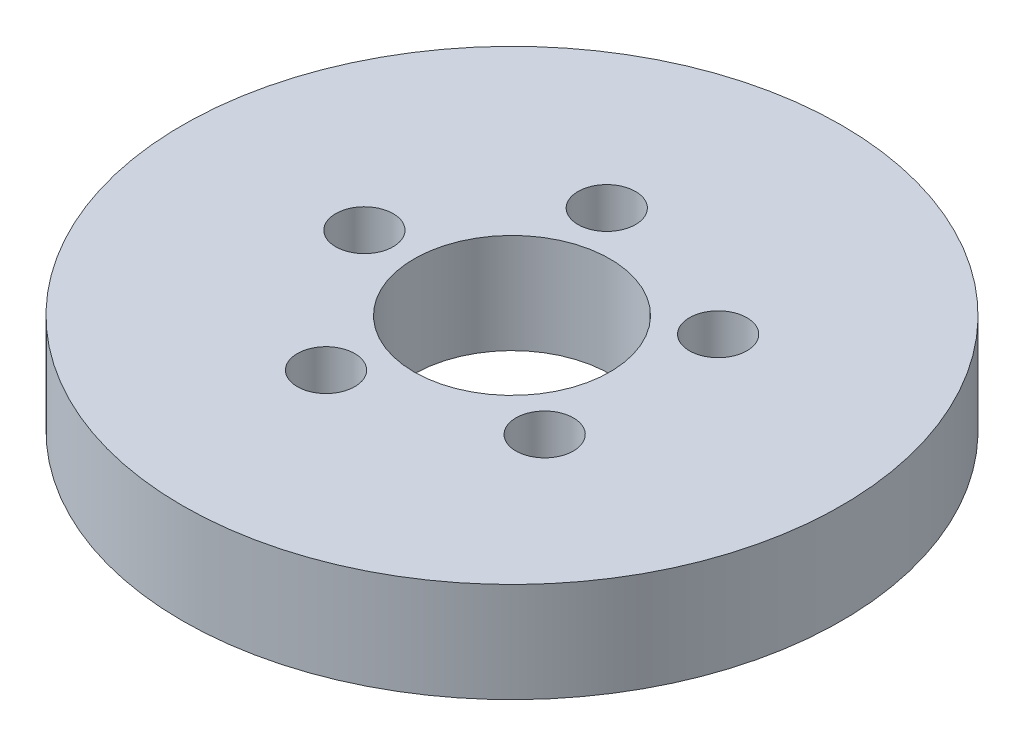
ISO-10303-21;
HEADER;
FILE_DESCRIPTION(('STEP AP214'),'2;1');
FILE_NAME('part.step','',(''),(''),'','','');
FILE_SCHEMA(('AUTOMOTIVE_DESIGN { 1 0 10303 214 1 1 1 1 }'));
ENDSEC;
DATA;
#1=APPLICATION_CONTEXT('core data for automotive mechanical design processes');
#2=APPLICATION_PROTOCOL_DEFINITION('international standard','automotive_design',2000,#1);
#3=PRODUCT_CONTEXT('',#1,'mechanical');
#4=PRODUCT('Part','Part','',(#3));
#5=PRODUCT_RELATED_PRODUCT_CATEGORY('part','',(#4));
#6=PRODUCT_DEFINITION_FORMATION('','',#4);
#7=PRODUCT_DEFINITION_CONTEXT('part definition',#1,'design');
#8=PRODUCT_DEFINITION('design','',#6,#7);
#9=PRODUCT_DEFINITION_SHAPE('','',#8);
#10=(LENGTH_UNIT() NAMED_UNIT(*) SI_UNIT(.MILLI.,.METRE.));
#11=(NAMED_UNIT(*) PLANE_ANGLE_UNIT() SI_UNIT($,.RADIAN.));
#12=(NAMED_UNIT(*) SI_UNIT($,.STERADIAN.) SOLID_ANGLE_UNIT());
#13=UNCERTAINTY_MEASURE_WITH_UNIT(LENGTH_MEASURE(1.E-05),#10,'distance_accuracy_value','');
#14=(GEOMETRIC_REPRESENTATION_CONTEXT(3) GLOBAL_UNCERTAINTY_ASSIGNED_CONTEXT((#13)) GLOBAL_UNIT_ASSIGNED_CONTEXT((#10,
#11,#12)) REPRESENTATION_CONTEXT('',''));
#15=CARTESIAN_POINT('',(0.,0.,0.));
#16=DIRECTION('',(0.,0.,1.));
#17=DIRECTION('',(1.,0.,0.));
#18=AXIS2_PLACEMENT_3D('',#15,#16,#17);
#19=CARTESIAN_POINT('',(0.,28.,0.));
#20=DIRECTION('',(0.,-1.,0.));
#21=DIRECTION('',(0.,0.,-1.));
#22=AXIS2_PLACEMENT_3D('',#19,#20,#21);
#23=CYLINDRICAL_SURFACE('',#22,92.5);
#24=CARTESIAN_POINT('',(0.,28.,0.));
#25=DIRECTION('',(0.,1.,0.));
#26=DIRECTION('',(0.,0.,1.));
#27=AXIS2_PLACEMENT_3D('',#24,#25,#26);
#28=CIRCLE('',#27,92.5);
#29=CARTESIAN_POINT('',(0.,28.,92.5));
#30=VERTEX_POINT('',#29);
#31=EDGE_CURVE('E10',#30,#30,#28,.T.);
#32=ORIENTED_EDGE('',*,*,#31,.F.);
#33=EDGE_LOOP('',(#32));
#34=FACE_BOUND('',#33,.T.);
#35=CARTESIAN_POINT('',(0.,0.,0.));
#36=DIRECTION('',(0.,1.,0.));
#37=DIRECTION('',(0.,0.,1.));
#38=AXIS2_PLACEMENT_3D('',#35,#36,#37);
#39=CIRCLE('',#38,92.5);
#40=CARTESIAN_POINT('',(0.,0.,92.5));
#41=VERTEX_POINT('',#40);
#42=EDGE_CURVE('E37',#41,#41,#39,.T.);
#43=ORIENTED_EDGE('',*,*,#42,.T.);
#44=EDGE_LOOP('',(#43));
#45=FACE_BOUND('',#44,.T.);
#46=ADVANCED_FACE('F40',(#34,#45),#23,.T.);
#47=CARTESIAN_POINT('',(0.,28.,0.));
#48=DIRECTION('',(0.,1.,0.));
#49=DIRECTION('',(0.,0.,1.));
#50=AXIS2_PLACEMENT_3D('',#47,#48,#49);
#51=PLANE('',#50);
#52=CARTESIAN_POINT('',(-12.8016377738142,28.,-39.3993898253473));
#53=DIRECTION('',(0.,1.,0.));
#54=DIRECTION('',(-0.95105651629515,0.,0.309016994374958));
#55=AXIS2_PLACEMENT_3D('',#52,#53,#54);
#56=CIRCLE('',#55,8.06723917707459);
#57=CARTESIAN_POINT('',(-20.4740381616825,28.,-36.9064758219438));
#58=VERTEX_POINT('',#57);
#59=EDGE_CURVE('E70',#58,#58,#56,.T.);
#60=ORIENTED_EDGE('',*,*,#59,.F.);
#61=EDGE_LOOP('',(#60));
#62=FACE_BOUND('',#61,.T.);
#63=CARTESIAN_POINT('',(33.5151228035087,28.,-24.3501620480718));
#64=DIRECTION('',(0.,1.,0.));
#65=DIRECTION('',(-0.58778525229248,0.,-0.809016994374942));
#66=AXIS2_PLACEMENT_3D('',#63,#64,#65);
#67=CIRCLE('',#66,8.06723917707459);
#68=CARTESIAN_POINT('',(28.7733185885082,28.,-30.8766956400125));
#69=VERTEX_POINT('',#68);
#70=EDGE_CURVE('E71',#69,#69,#67,.T.);
#71=ORIENTED_EDGE('',*,*,#70,.F.);
#72=EDGE_LOOP('',(#71));
#73=FACE_BOUND('',#72,.T.);
#74=CARTESIAN_POINT('',(33.5151228035091,28.,24.3501620480713));
#75=DIRECTION('',(0.,1.,0.));
#76=DIRECTION('',(0.587785252292469,0.,-0.809016994374951));
#77=AXIS2_PLACEMENT_3D('',#74,#75,#76);
#78=CIRCLE('',#77,8.06723917707459);
#79=CARTESIAN_POINT('',(38.2569270185095,28.,17.8236284561306));
#80=VERTEX_POINT('',#79);
#81=EDGE_CURVE('E78',#80,#80,#78,.T.);
#82=ORIENTED_EDGE('',*,*,#81,.F.);
#83=EDGE_LOOP('',(#82));
#84=FACE_BOUND('',#83,.T.);
#85=CARTESIAN_POINT('',(-12.8016377738136,28.,39.3993898253475));
#86=DIRECTION('',(0.,1.,0.));
#87=DIRECTION('',(0.951056516295155,0.,0.309016994374945));
#88=AXIS2_PLACEMENT_3D('',#85,#86,#87);
#89=CIRCLE('',#88,8.06723917707459);
#90=CARTESIAN_POINT('',(-5.12923738594529,28.,41.8923038287509));
#91=VERTEX_POINT('',#90);
#92=EDGE_CURVE('E61',#91,#91,#89,.T.);
#93=ORIENTED_EDGE('',*,*,#92,.F.);
#94=EDGE_LOOP('',(#93));
#95=FACE_BOUND('',#94,.T.);
#96=CARTESIAN_POINT('',(-41.4269700593904,28.,0.));
#97=DIRECTION('',(0.,1.,0.));
#98=DIRECTION('',(0.,0.,1.));
#99=AXIS2_PLACEMENT_3D('',#96,#97,#98);
#100=CIRCLE('',#99,8.06723917707459);
#101=CARTESIAN_POINT('',(-41.4269700593904,28.,8.06723917707459));
#102=VERTEX_POINT('',#101);
#103=EDGE_CURVE('E54',#102,#102,#100,.T.);
#104=ORIENTED_EDGE('',*,*,#103,.F.);
#105=EDGE_LOOP('',(#104));
#106=FACE_BOUND('',#105,.T.);
#107=CARTESIAN_POINT('',(0.,28.,0.));
#108=DIRECTION('',(0.,1.,0.));
#109=DIRECTION('',(0.,0.,1.));
#110=AXIS2_PLACEMENT_3D('',#107,#108,#109);
#111=CIRCLE('',#110,27.5);
#112=CARTESIAN_POINT('',(0.,28.,27.5));
#113=VERTEX_POINT('',#112);
#114=EDGE_CURVE('E50',#113,#113,#111,.T.);
#115=ORIENTED_EDGE('',*,*,#114,.F.);
#116=EDGE_LOOP('',(#115));
#117=FACE_BOUND('',#116,.T.);
#118=ORIENTED_EDGE('',*,*,#31,.T.);
#119=EDGE_LOOP('',(#118));
#120=FACE_BOUND('',#119,.T.);
#121=ADVANCED_FACE('F94',(#62,#73,#84,#95,#106,#117,#120),#51,.T.);
#122=CARTESIAN_POINT('',(0.,0.,0.));
#123=DIRECTION('',(0.,1.,0.));
#124=DIRECTION('',(0.,0.,1.));
#125=AXIS2_PLACEMENT_3D('',#122,#123,#124);
#126=PLANE('',#125);
#127=CARTESIAN_POINT('',(0.,0.,0.));
#128=DIRECTION('',(0.,1.,0.));
#129=DIRECTION('',(0.,0.,1.));
#130=AXIS2_PLACEMENT_3D('',#127,#128,#129);
#131=CIRCLE('',#130,27.5);
#132=CARTESIAN_POINT('',(0.,0.,27.5));
#133=VERTEX_POINT('',#132);
#134=EDGE_CURVE('E47',#133,#133,#131,.T.);
#135=ORIENTED_EDGE('',*,*,#134,.T.);
#136=EDGE_LOOP('',(#135));
#137=FACE_BOUND('',#136,.T.);
#138=ORIENTED_EDGE('',*,*,#42,.F.);
#139=EDGE_LOOP('',(#138));
#140=FACE_BOUND('',#139,.T.);
#141=ADVANCED_FACE('F100',(#137,#140),#126,.F.);
#142=CARTESIAN_POINT('',(0.,28.,0.));
#143=DIRECTION('',(0.,-1.,0.));
#144=DIRECTION('',(0.,0.,-1.));
#145=AXIS2_PLACEMENT_3D('',#142,#143,#144);
#146=CYLINDRICAL_SURFACE('',#145,27.5);
#147=ORIENTED_EDGE('',*,*,#114,.T.);
#148=EDGE_LOOP('',(#147));
#149=FACE_BOUND('',#148,.T.);
#150=ORIENTED_EDGE('',*,*,#134,.F.);
#151=EDGE_LOOP('',(#150));
#152=FACE_BOUND('',#151,.T.);
#153=ADVANCED_FACE('F106',(#149,#152),#146,.F.);
#154=CARTESIAN_POINT('',(-41.4269700593904,6.37404687417219,0.));
#155=DIRECTION('',(0.,1.,0.));
#156=DIRECTION('',(0.,0.,1.));
#157=AXIS2_PLACEMENT_3D('',#154,#155,#156);
#158=CYLINDRICAL_SURFACE('',#157,8.06723917707459);
#159=CARTESIAN_POINT('',(-41.4269700593904,6.37404687417219,0.));
#160=DIRECTION('',(0.,1.,0.));
#161=DIRECTION('',(0.,0.,1.));
#162=AXIS2_PLACEMENT_3D('',#159,#160,#161);
#163=CIRCLE('',#162,8.06723917707459);
#164=CARTESIAN_POINT('',(-41.4269700593904,6.37404687417219,8.06723917707459));
#165=VERTEX_POINT('',#164);
#166=EDGE_CURVE('E55',#165,#165,#163,.T.);
#167=ORIENTED_EDGE('',*,*,#166,.F.);
#168=EDGE_LOOP('',(#167));
#169=FACE_BOUND('',#168,.T.);
#170=ORIENTED_EDGE('',*,*,#103,.T.);
#171=EDGE_LOOP('',(#170));
#172=FACE_BOUND('',#171,.T.);
#173=ADVANCED_FACE('F108',(#169,#172),#158,.F.);
#174=CARTESIAN_POINT('',(-41.4269700593904,6.37404687417219,0.));
#175=DIRECTION('',(0.,1.,0.));
#176=DIRECTION('',(0.,0.,1.));
#177=AXIS2_PLACEMENT_3D('',#174,#175,#176);
#178=PLANE('',#177);
#179=ORIENTED_EDGE('',*,*,#166,.T.);
#180=EDGE_LOOP('',(#179));
#181=FACE_BOUND('',#180,.T.);
#182=ADVANCED_FACE('F138',(#181),#178,.T.);
#183=CARTESIAN_POINT('',(-12.8016377738136,6.37404687417219,39.3993898253475));
#184=DIRECTION('',(0.,1.,0.));
#185=DIRECTION('',(0.,0.,1.));
#186=AXIS2_PLACEMENT_3D('',#183,#184,#185);
#187=CYLINDRICAL_SURFACE('',#186,8.06723917707459);
#188=CARTESIAN_POINT('',(-12.8016377738136,6.37404687417219,39.3993898253475));
#189=DIRECTION('',(0.,1.,0.));
#190=DIRECTION('',(0.951056516295155,0.,0.309016994374945));
#191=AXIS2_PLACEMENT_3D('',#188,#189,#190);
#192=CIRCLE('',#191,8.06723917707459);
#193=CARTESIAN_POINT('',(-5.12923738594529,6.37404687417219,41.8923038287509));
#194=VERTEX_POINT('',#193);
#195=EDGE_CURVE('E59',#194,#194,#192,.T.);
#196=ORIENTED_EDGE('',*,*,#195,.F.);
#197=EDGE_LOOP('',(#196));
#198=FACE_BOUND('',#197,.T.);
#199=ORIENTED_EDGE('',*,*,#92,.T.);
#200=EDGE_LOOP('',(#199));
#201=FACE_BOUND('',#200,.T.);
#202=ADVANCED_FACE('F150',(#198,#201),#187,.F.);
#203=CARTESIAN_POINT('',(-12.8016377738136,6.37404687417219,39.3993898253475));
#204=DIRECTION('',(0.,1.,0.));
#205=DIRECTION('',(0.951056516295155,0.,0.309016994374945));
#206=AXIS2_PLACEMENT_3D('',#203,#204,#205);
#207=PLANE('',#206);
#208=ORIENTED_EDGE('',*,*,#195,.T.);
#209=EDGE_LOOP('',(#208));
#210=FACE_BOUND('',#209,.T.);
#211=ADVANCED_FACE('F89',(#210),#207,.T.);
#212=CARTESIAN_POINT('',(33.5151228035091,6.37404687417219,24.3501620480713));
#213=DIRECTION('',(0.,1.,0.));
#214=DIRECTION('',(0.,0.,1.));
#215=AXIS2_PLACEMENT_3D('',#212,#213,#214);
#216=CYLINDRICAL_SURFACE('',#215,8.06723917707459);
#217=CARTESIAN_POINT('',(33.5151228035091,6.37404687417219,24.3501620480713));
#218=DIRECTION('',(0.,1.,0.));
#219=DIRECTION('',(0.587785252292469,0.,-0.809016994374951));
#220=AXIS2_PLACEMENT_3D('',#217,#218,#219);
#221=CIRCLE('',#220,8.06723917707459);
#222=CARTESIAN_POINT('',(38.2569270185095,6.37404687417219,17.8236284561306));
#223=VERTEX_POINT('',#222);
#224=EDGE_CURVE('E63',#223,#223,#221,.T.);
#225=ORIENTED_EDGE('',*,*,#224,.F.);
#226=EDGE_LOOP('',(#225));
#227=FACE_BOUND('',#226,.T.);
#228=ORIENTED_EDGE('',*,*,#81,.T.);
#229=EDGE_LOOP('',(#228));
#230=FACE_BOUND('',#229,.T.);
#231=ADVANCED_FACE('F87',(#227,#230),#216,.F.);
#232=CARTESIAN_POINT('',(33.5151228035091,6.37404687417219,24.3501620480713));
#233=DIRECTION('',(0.,1.,0.));
#234=DIRECTION('',(0.587785252292469,0.,-0.809016994374951));
#235=AXIS2_PLACEMENT_3D('',#232,#233,#234);
#236=PLANE('',#235);
#237=ORIENTED_EDGE('',*,*,#224,.T.);
#238=EDGE_LOOP('',(#237));
#239=FACE_BOUND('',#238,.T.);
#240=ADVANCED_FACE('F84',(#239),#236,.T.);
#241=CARTESIAN_POINT('',(33.5151228035087,6.37404687417219,-24.3501620480718));
#242=DIRECTION('',(0.,1.,0.));
#243=DIRECTION('',(0.,0.,1.));
#244=AXIS2_PLACEMENT_3D('',#241,#242,#243);
#245=CYLINDRICAL_SURFACE('',#244,8.06723917707459);
#246=CARTESIAN_POINT('',(33.5151228035087,6.37404687417219,-24.3501620480718));
#247=DIRECTION('',(0.,1.,0.));
#248=DIRECTION('',(-0.58778525229248,0.,-0.809016994374942));
#249=AXIS2_PLACEMENT_3D('',#246,#247,#248);
#250=CIRCLE('',#249,8.06723917707459);
#251=CARTESIAN_POINT('',(28.7733185885082,6.37404687417219,-30.8766956400125));
#252=VERTEX_POINT('',#251);
#253=EDGE_CURVE('E76',#252,#252,#250,.T.);
#254=ORIENTED_EDGE('',*,*,#253,.F.);
#255=EDGE_LOOP('',(#254));
#256=FACE_BOUND('',#255,.T.);
#257=ORIENTED_EDGE('',*,*,#70,.T.);
#258=EDGE_LOOP('',(#257));
#259=FACE_BOUND('',#258,.T.);
#260=ADVANCED_FACE('F185',(#256,#259),#245,.F.);
#261=CARTESIAN_POINT('',(33.5151228035087,6.37404687417219,-24.3501620480718));
#262=DIRECTION('',(0.,1.,0.));
#263=DIRECTION('',(-0.58778525229248,0.,-0.809016994374942));
#264=AXIS2_PLACEMENT_3D('',#261,#262,#263);
#265=PLANE('',#264);
#266=ORIENTED_EDGE('',*,*,#253,.T.);
#267=EDGE_LOOP('',(#266));
#268=FACE_BOUND('',#267,.T.);
#269=ADVANCED_FACE('F189',(#268),#265,.T.);
#270=CARTESIAN_POINT('',(-12.8016377738142,6.37404687417219,-39.3993898253473));
#271=DIRECTION('',(0.,1.,0.));
#272=DIRECTION('',(0.,0.,1.));
#273=AXIS2_PLACEMENT_3D('',#270,#271,#272);
#274=CYLINDRICAL_SURFACE('',#273,8.06723917707459);
#275=CARTESIAN_POINT('',(-12.8016377738142,6.37404687417219,-39.3993898253473));
#276=DIRECTION('',(0.,1.,0.));
#277=DIRECTION('',(-0.95105651629515,0.,0.309016994374958));
#278=AXIS2_PLACEMENT_3D('',#275,#276,#277);
#279=CIRCLE('',#278,8.06723917707459);
#280=CARTESIAN_POINT('',(-20.4740381616825,6.37404687417219,-36.9064758219438));
#281=VERTEX_POINT('',#280);
#282=EDGE_CURVE('E69',#281,#281,#279,.T.);
#283=ORIENTED_EDGE('',*,*,#282,.F.);
#284=EDGE_LOOP('',(#283));
#285=FACE_BOUND('',#284,.T.);
#286=ORIENTED_EDGE('',*,*,#59,.T.);
#287=EDGE_LOOP('',(#286));
#288=FACE_BOUND('',#287,.T.);
#289=ADVANCED_FACE('F200',(#285,#288),#274,.F.);
#290=CARTESIAN_POINT('',(-12.8016377738142,6.37404687417219,-39.3993898253473));
#291=DIRECTION('',(0.,1.,0.));
#292=DIRECTION('',(-0.95105651629515,0.,0.309016994374958));
#293=AXIS2_PLACEMENT_3D('',#290,#291,#292);
#294=PLANE('',#293);
#295=ORIENTED_EDGE('',*,*,#282,.T.);
#296=EDGE_LOOP('',(#295));
#297=FACE_BOUND('',#296,.T.);
#298=ADVANCED_FACE('F208',(#297),#294,.T.);
#299=CLOSED_SHELL('',(#46,#121,#141,#153,#173,#182,#202,#211,#231,#240,#260,#269,#289,#298));
#300=MANIFOLD_SOLID_BREP('B2',#299);
#301=ADVANCED_BREP_SHAPE_REPRESENTATION('',(#18,#300),#14);
#302=SHAPE_DEFINITION_REPRESENTATION(#9,#301);
ENDSEC;
END-ISO-10303-21;
